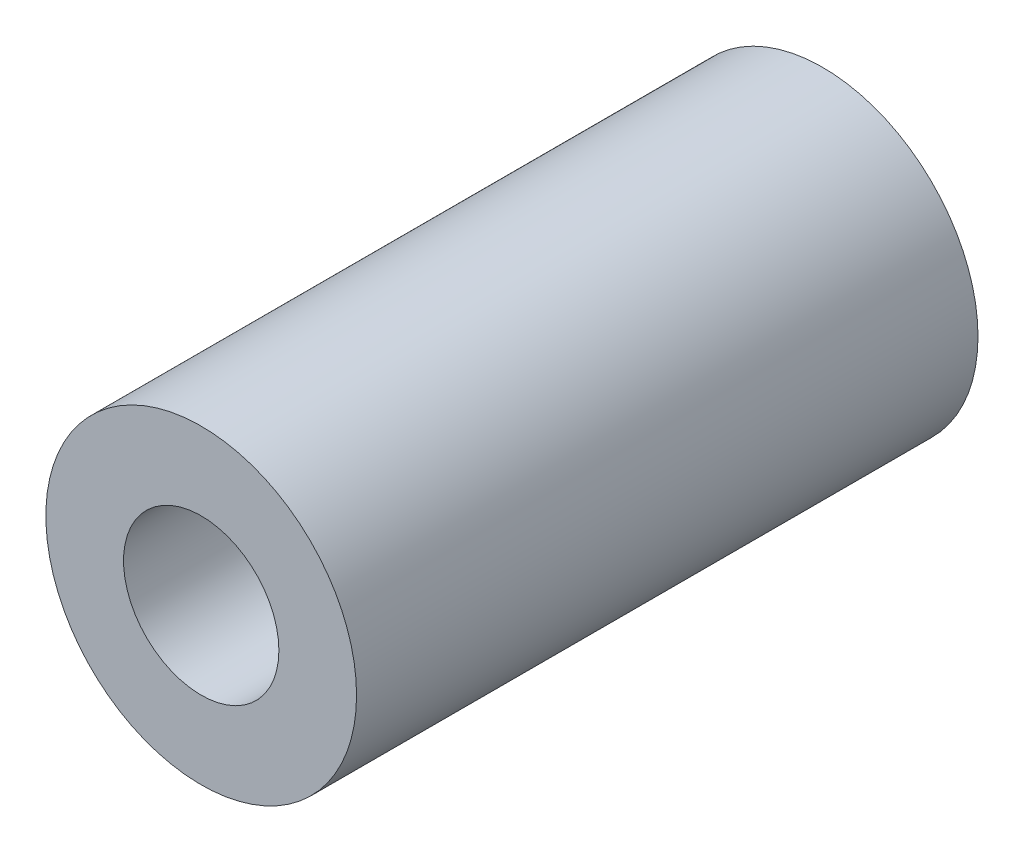
ISO-10303-21;
HEADER;
FILE_DESCRIPTION(('STEP AP214'),'2;1');
FILE_NAME('part.step','',(''),(''),'','','');
FILE_SCHEMA(('AUTOMOTIVE_DESIGN { 1 0 10303 214 1 1 1 1 }'));
ENDSEC;
DATA;
#1=APPLICATION_CONTEXT('core data for automotive mechanical design processes');
#2=APPLICATION_PROTOCOL_DEFINITION('international standard','automotive_design',2000,#1);
#3=PRODUCT_CONTEXT('',#1,'mechanical');
#4=PRODUCT('Part','Part','',(#3));
#5=PRODUCT_RELATED_PRODUCT_CATEGORY('part','',(#4));
#6=PRODUCT_DEFINITION_FORMATION('','',#4);
#7=PRODUCT_DEFINITION_CONTEXT('part definition',#1,'design');
#8=PRODUCT_DEFINITION('design','',#6,#7);
#9=PRODUCT_DEFINITION_SHAPE('','',#8);
#10=(LENGTH_UNIT() NAMED_UNIT(*) SI_UNIT(.MILLI.,.METRE.));
#11=(NAMED_UNIT(*) PLANE_ANGLE_UNIT() SI_UNIT($,.RADIAN.));
#12=(NAMED_UNIT(*) SI_UNIT($,.STERADIAN.) SOLID_ANGLE_UNIT());
#13=UNCERTAINTY_MEASURE_WITH_UNIT(LENGTH_MEASURE(1.E-05),#10,'distance_accuracy_value','');
#14=(GEOMETRIC_REPRESENTATION_CONTEXT(3) GLOBAL_UNCERTAINTY_ASSIGNED_CONTEXT((#13)) GLOBAL_UNIT_ASSIGNED_CONTEXT((#10,
#11,#12)) REPRESENTATION_CONTEXT('',''));
#15=CARTESIAN_POINT('',(0.,0.,0.));
#16=DIRECTION('',(0.,0.,1.));
#17=DIRECTION('',(1.,0.,0.));
#18=AXIS2_PLACEMENT_3D('',#15,#16,#17);
#19=CARTESIAN_POINT('',(0.,0.,20.));
#20=DIRECTION('',(0.,0.,1.));
#21=DIRECTION('',(1.,0.,0.));
#22=AXIS2_PLACEMENT_3D('',#19,#20,#21);
#23=PLANE('',#22);
#24=CARTESIAN_POINT('',(0.,0.,20.));
#25=DIRECTION('',(0.,0.,1.));
#26=DIRECTION('',(1.,0.,0.));
#27=AXIS2_PLACEMENT_3D('',#24,#25,#26);
#28=CIRCLE('',#27,5.);
#29=CARTESIAN_POINT('',(5.,0.,20.));
#30=VERTEX_POINT('',#29);
#31=EDGE_CURVE('E10',#30,#30,#28,.T.);
#32=ORIENTED_EDGE('',*,*,#31,.T.);
#33=EDGE_LOOP('',(#32));
#34=FACE_BOUND('',#33,.T.);
#35=CARTESIAN_POINT('',(0.,0.,20.));
#36=DIRECTION('',(0.,0.,1.));
#37=DIRECTION('',(1.,0.,0.));
#38=AXIS2_PLACEMENT_3D('',#35,#36,#37);
#39=CIRCLE('',#38,2.5);
#40=CARTESIAN_POINT('',(2.5,0.,20.));
#41=VERTEX_POINT('',#40);
#42=EDGE_CURVE('E48',#41,#41,#39,.T.);
#43=ORIENTED_EDGE('',*,*,#42,.F.);
#44=EDGE_LOOP('',(#43));
#45=FACE_BOUND('',#44,.T.);
#46=ADVANCED_FACE('F30',(#34,#45),#23,.T.);
#47=CARTESIAN_POINT('',(0.,0.,0.));
#48=DIRECTION('',(0.,0.,1.));
#49=DIRECTION('',(1.,0.,0.));
#50=AXIS2_PLACEMENT_3D('',#47,#48,#49);
#51=PLANE('',#50);
#52=CARTESIAN_POINT('',(0.,0.,0.));
#53=DIRECTION('',(0.,0.,1.));
#54=DIRECTION('',(1.,0.,0.));
#55=AXIS2_PLACEMENT_3D('',#52,#53,#54);
#56=CIRCLE('',#55,5.);
#57=CARTESIAN_POINT('',(5.,0.,0.));
#58=VERTEX_POINT('',#57);
#59=EDGE_CURVE('E43',#58,#58,#56,.T.);
#60=ORIENTED_EDGE('',*,*,#59,.F.);
#61=EDGE_LOOP('',(#60));
#62=FACE_BOUND('',#61,.T.);
#63=CARTESIAN_POINT('',(0.,0.,0.));
#64=DIRECTION('',(0.,0.,1.));
#65=DIRECTION('',(1.,0.,0.));
#66=AXIS2_PLACEMENT_3D('',#63,#64,#65);
#67=CIRCLE('',#66,2.5);
#68=CARTESIAN_POINT('',(2.5,0.,0.));
#69=VERTEX_POINT('',#68);
#70=EDGE_CURVE('E51',#69,#69,#67,.T.);
#71=ORIENTED_EDGE('',*,*,#70,.T.);
#72=EDGE_LOOP('',(#71));
#73=FACE_BOUND('',#72,.T.);
#74=ADVANCED_FACE('F83',(#62,#73),#51,.F.);
#75=CARTESIAN_POINT('',(0.,0.,20.));
#76=DIRECTION('',(0.,0.,-1.));
#77=DIRECTION('',(-1.,0.,0.));
#78=AXIS2_PLACEMENT_3D('',#75,#76,#77);
#79=CYLINDRICAL_SURFACE('',#78,5.);
#80=CARTESIAN_POINT('',(0.0985903955593224,-4.99902789889229,16.5));
#81=CARTESIAN_POINT('',(0.181173988985378,-4.9973983172279,16.4999987992113));
#82=CARTESIAN_POINT('',(0.263728738356211,-4.99370407236498,16.4931570552624));
#83=CARTESIAN_POINT('',(0.426350404439952,-4.98245705223203,16.4660744697368));
#84=CARTESIAN_POINT('',(0.506416420914054,-4.9749028975741,16.4458288373446));
#85=CARTESIAN_POINT('',(0.661696215089522,-4.95663841633571,16.3927079981128));
#86=CARTESIAN_POINT('',(0.736917699734912,-4.94593326167626,16.3598534603673));
#87=CARTESIAN_POINT('',(0.880754690080715,-4.92235615652566,16.2825325104784));
#88=CARTESIAN_POINT('',(0.949369336947769,-4.90948392492886,16.2380645914747));
#89=CARTESIAN_POINT('',(1.080194492723,-4.88239405460184,16.1373043630164));
#90=CARTESIAN_POINT('',(1.142169426443,-4.86814868700865,16.080713593736));
#91=CARTESIAN_POINT('',(1.25589049671119,-4.84005962388498,15.95794553586));
#92=CARTESIAN_POINT('',(1.30763485996599,-4.82621599834375,15.8917665887575));
#93=CARTESIAN_POINT('',(1.40045695660295,-4.80011455823837,15.7499790457013));
#94=CARTESIAN_POINT('',(1.44129145890563,-4.78789554562473,15.6742034773311));
#95=CARTESIAN_POINT('',(1.50952100476533,-4.76682610450009,15.5163899104987));
#96=CARTESIAN_POINT('',(1.536920009479,-4.7579746833026,15.4343537660806));
#97=CARTESIAN_POINT('',(1.57657092487179,-4.7449814058997,15.2693108155071));
#98=CARTESIAN_POINT('',(1.58930768207363,-4.74068918715845,15.1864325955547));
#99=CARTESIAN_POINT('',(1.60078894500709,-4.73682543999125,15.0196130329558));
#100=CARTESIAN_POINT('',(1.59953721305366,-4.73725264223929,14.9356719822327));
#101=CARTESIAN_POINT('',(1.58343703019074,-4.74265640987733,14.77269731186));
#102=CARTESIAN_POINT('',(1.56913870400632,-4.74744889392073,14.693602270107));
#103=CARTESIAN_POINT('',(1.52823146264147,-4.76077376148698,14.5389984944901));
#104=CARTESIAN_POINT('',(1.50162123089739,-4.76930654497059,14.4634901451187));
#105=CARTESIAN_POINT('',(1.43642853190503,-4.78934731805012,14.3168218167906));
#106=CARTESIAN_POINT('',(1.39766389555963,-4.8009001008894,14.2457491807883));
#107=CARTESIAN_POINT('',(1.3094039846586,-4.82571838590428,14.1109411095385));
#108=CARTESIAN_POINT('',(1.25990587573618,-4.83898434009868,14.0472076191437));
#109=CARTESIAN_POINT('',(1.14881136010374,-4.86658559202589,13.9256956759889));
#110=CARTESIAN_POINT('',(1.08675108631114,-4.88094172939616,13.8683453140252));
#111=CARTESIAN_POINT('',(0.953748889253743,-4.90866295357523,13.7647633947733));
#112=CARTESIAN_POINT('',(0.882806089834772,-4.9220279424118,13.7185329356455));
#113=CARTESIAN_POINT('',(0.732992428130799,-4.94656849697763,13.6380744382917));
#114=CARTESIAN_POINT('',(0.654041653887453,-4.95771785809937,13.6039866607176));
#115=CARTESIAN_POINT('',(0.491102156661873,-4.97649804758986,13.5497234530094));
#116=CARTESIAN_POINT('',(0.407114865575967,-4.98412987069555,13.5295440888655));
#117=CARTESIAN_POINT('',(0.239764307308273,-4.99492604403972,13.5043505200061));
#118=CARTESIAN_POINT('',(0.15649013962331,-4.99824327839354,13.4988097099639));
#119=CARTESIAN_POINT('',(-0.00987844125090942,-5.000681914396,13.5016165257023));
#120=CARTESIAN_POINT('',(-0.0929728814923826,-4.99980399890829,13.5099618910229));
#121=CARTESIAN_POINT('',(-0.25425942316383,-4.99416589488461,13.539848400854));
#122=CARTESIAN_POINT('',(-0.332523384867446,-4.98951188449976,13.561024686254));
#123=CARTESIAN_POINT('',(-0.484406420466471,-4.97706354014433,13.6155767059439));
#124=CARTESIAN_POINT('',(-0.558025034986488,-4.96926889615966,13.6489536445385));
#125=CARTESIAN_POINT('',(-0.700068339682323,-4.95127559566397,13.7276555344731));
#126=CARTESIAN_POINT('',(-0.768370202798684,-4.94103472126363,13.7731921841474));
#127=CARTESIAN_POINT('',(-0.896552493949022,-4.91939287686458,13.8746661105315));
#128=CARTESIAN_POINT('',(-0.956430950569154,-4.9079916363663,13.9306058148823));
#129=CARTESIAN_POINT('',(-1.06825148717409,-4.88489687066707,14.0536233781555));
#130=CARTESIAN_POINT('',(-1.11983984327532,-4.87320719084736,14.1210240902566));
#131=CARTESIAN_POINT('',(-1.21102100551567,-4.85135386379471,14.263734297198));
#132=CARTESIAN_POINT('',(-1.25061386645485,-4.8411902095904,14.3390437559059));
#133=CARTESIAN_POINT('',(-1.3165619986761,-4.82367440731655,14.4954811093413));
#134=CARTESIAN_POINT('',(-1.34293097892513,-4.81631934951951,14.576602878391));
#135=CARTESIAN_POINT('',(-1.38156760545744,-4.80538047414142,14.7423761017078));
#136=CARTESIAN_POINT('',(-1.39383941193629,-4.80179554399013,14.8270265069987));
#137=CARTESIAN_POINT('',(-1.4036482667934,-4.79893686789022,14.9941716717836));
#138=CARTESIAN_POINT('',(-1.40170139292323,-4.7995121174673,15.0766338911978));
#139=CARTESIAN_POINT('',(-1.38436096481662,-4.80454205624111,15.2400052012012));
#140=CARTESIAN_POINT('',(-1.36896788464283,-4.80899660866819,15.3209143464433));
#141=CARTESIAN_POINT('',(-1.3255136732467,-4.82115236973497,15.4780159469491));
#142=CARTESIAN_POINT('',(-1.29759396113538,-4.82881727267182,15.5542505427344));
#143=CARTESIAN_POINT('',(-1.22998372298,-4.84647864290636,15.7010148685009));
#144=CARTESIAN_POINT('',(-1.19029109212225,-4.85647552705751,15.7715435754863));
#145=CARTESIAN_POINT('',(-1.09875064120333,-4.87801417569673,15.9073561586161));
#146=CARTESIAN_POINT('',(-1.04655174787859,-4.8895953981307,15.9723971760437));
#147=CARTESIAN_POINT('',(-0.932101719939085,-4.91269670380159,16.0929708972985));
#148=CARTESIAN_POINT('',(-0.869848289034929,-4.92421677244975,16.1485014231039));
#149=CARTESIAN_POINT('',(-0.735274414661024,-4.94612178801429,16.2497700112115));
#150=CARTESIAN_POINT('',(-0.662751601481626,-4.95647365665806,16.2952469809488));
#151=CARTESIAN_POINT('',(-0.510775238424414,-4.97442936251991,16.3733032991901));
#152=CARTESIAN_POINT('',(-0.431325238834449,-4.98203459727096,16.4058892076878));
#153=CARTESIAN_POINT('',(-0.277287227964994,-4.99283166841481,16.4541171128241));
#154=CARTESIAN_POINT('',(-0.203202565546461,-4.99643278300545,16.4712849228124));
#155=CARTESIAN_POINT('',(-0.0532068532679359,-5.00027938704365,16.4942261498202));
#156=CARTESIAN_POINT('',(0.0227039488999433,-5.00052532903455,16.5000011034103));
#157=CARTESIAN_POINT('',(0.0985903955593224,-4.99902789889229,16.5));
#158=B_SPLINE_CURVE_WITH_KNOTS('',3,(#80,#81,#82,#83,#84,#85,#86,#87,#88,#89,#90,#91,#92,#93,
#94,#95,#96,#97,#98,#99,#100,#101,#102,#103,#104,#105,#106,#107,#108,#109,#110,#111,#112,#113,
#114,#115,#116,#117,#118,#119,#120,#121,#122,#123,#124,#125,#126,#127,#128,#129,#130,#131,#132,
#133,#134,#135,#136,#137,#138,#139,#140,#141,#142,#143,#144,#145,#146,#147,#148,#149,#150,#151,
#152,#153,#154,#155,#156,#157),.UNSPECIFIED.,.T.,.F.,(4,2,2,2,2,2,2,2,2,2,2,2,2,2,2,2,2,2,2,2,2,
2,2,2,2,2,2,2,2,2,2,2,2,2,2,2,2,2,4),(0.,0.247518225957796,0.49512496763348,0.742327542829275,
0.989562209021944,1.24377883789113,1.4980394922835,1.75756850089457,2.01702094709477,
2.26762234345193,2.51815634020152,2.75859118260316,2.99905174165435,3.24330403366689,
3.48762090361346,3.74357185311516,3.99954806901418,4.25839189369009,4.51716247403042,
4.76648866591083,5.01577427521348,5.25828370492414,5.5008170787736,5.74788451379765,
5.99500967661836,6.25083713513628,6.50666342491748,6.76222395294259,7.01770904349717,
7.26396843388298,7.51021914243955,7.75375715554467,7.99733873570878,8.24878473956704,
8.50028825093171,8.75770823733976,9.01499705903001,9.24247338591796,9.46991903065354),.UNSPECIFIED.);
#159=CARTESIAN_POINT('',(0.0985903955593224,-4.99902789889229,16.5));
#160=VERTEX_POINT('',#159);
#161=EDGE_CURVE('E59',#160,#160,#158,.T.);
#162=ORIENTED_EDGE('',*,*,#161,.T.);
#163=EDGE_LOOP('',(#162));
#164=FACE_BOUND('',#163,.T.);
#165=CARTESIAN_POINT('',(0.0328634651864408,-4.99989199809915,6.5));
#166=CARTESIAN_POINT('',(0.115248001643515,-4.99934973441225,6.49999893406111));
#167=CARTESIAN_POINT('',(0.197629720343009,-4.99675318781283,6.49319018861387));
#168=CARTESIAN_POINT('',(0.359966304170237,-4.9876890439514,6.46621258847347));
#169=CARTESIAN_POINT('',(0.439920389174807,-4.98122021587519,6.4460394856688));
#170=CARTESIAN_POINT('',(0.595038267886345,-4.96507862223594,6.39307831244412));
#171=CARTESIAN_POINT('',(0.670209184352877,-4.95541076020943,6.36030953654759));
#172=CARTESIAN_POINT('',(0.813979634353618,-4.9338350933806,6.28316655984981));
#173=CARTESIAN_POINT('',(0.88257829916274,-4.92192699307674,6.23879082771617));
#174=CARTESIAN_POINT('',(1.01328682786246,-4.89671337761127,6.1383080074087));
#175=CARTESIAN_POINT('',(1.07517497570127,-4.88337907354336,6.08191973136557));
#176=CARTESIAN_POINT('',(1.18876810013055,-4.85697829937537,5.95961052272823));
#177=CARTESIAN_POINT('',(1.2404713456072,-4.84391187514402,5.8936879729031));
#178=CARTESIAN_POINT('',(1.33332641756892,-4.8191914809674,5.75239341807298));
#179=CARTESIAN_POINT('',(1.37422192717641,-4.80757477923355,5.67684586019084));
#180=CARTESIAN_POINT('',(1.44263071450651,-4.78749380844821,5.51952670847073));
#181=CARTESIAN_POINT('',(1.47014743889427,-4.77902872760263,5.43775672394944));
#182=CARTESIAN_POINT('',(1.51019242824283,-4.76652387133911,5.27290361876238));
#183=CARTESIAN_POINT('',(1.5231453663051,-4.76235901866462,5.18993338464248));
#184=CARTESIAN_POINT('',(1.53502229771446,-4.75854485317958,5.02290095818472));
#185=CARTESIAN_POINT('',(1.53394981382914,-4.75889440648465,4.93883904534301));
#186=CARTESIAN_POINT('',(1.51813307764928,-4.76396181434415,4.77535048562231));
#187=CARTESIAN_POINT('',(1.50390275886481,-4.76851545103815,4.69586819607809));
#188=CARTESIAN_POINT('',(1.46300210571095,-4.78122148454177,4.54047835209565));
#189=CARTESIAN_POINT('',(1.43633051055633,-4.78937424607825,4.46457116081247));
#190=CARTESIAN_POINT('',(1.37092256084189,-4.80850730374437,4.31721876462094));
#191=CARTESIAN_POINT('',(1.33201844021736,-4.81952652577899,4.24585329606884));
#192=CARTESIAN_POINT('',(1.24337095727181,-4.84315268083182,4.11049397209804));
#193=CARTESIAN_POINT('',(1.19362488928045,-4.85576000983924,4.04650196287327));
#194=CARTESIAN_POINT('',(1.08214051167373,-4.88184222163665,3.92476881558514));
#195=CARTESIAN_POINT('',(1.01997336631808,-4.89533094734143,3.86742269600741));
#196=CARTESIAN_POINT('',(0.88674727286039,-4.92120695579042,3.76387678172719));
#197=CARTESIAN_POINT('',(0.815687661482507,-4.93359415625548,3.71767781922804));
#198=CARTESIAN_POINT('',(0.665884329093425,-4.95604409225237,3.63744350745642));
#199=CARTESIAN_POINT('',(0.587082662254729,-4.9660870450066,3.60351044003789));
#200=CARTESIAN_POINT('',(0.424514906891193,-4.98261489875482,3.54950365597748));
#201=CARTESIAN_POINT('',(0.34075021781116,-4.98910079750593,3.52942605245588));
#202=CARTESIAN_POINT('',(0.173876620590497,-4.99764885120166,3.50434765522393));
#203=CARTESIAN_POINT('',(0.0908532529488043,-4.99986228837017,3.49882862461061));
#204=CARTESIAN_POINT('',(-0.0749635896837471,-5.00012508759384,3.50158536271815));
#205=CARTESIAN_POINT('',(-0.157757095885825,-4.99817504575956,3.50985915659945));
#206=CARTESIAN_POINT('',(-0.318684237489182,-4.99046886420399,3.53953795341165));
#207=CARTESIAN_POINT('',(-0.396882102638044,-4.98480566677105,3.56062140171428));
#208=CARTESIAN_POINT('',(-0.548625458419852,-4.97039475582472,3.61494860201404));
#209=CARTESIAN_POINT('',(-0.622170421798301,-4.96164669347835,3.64819372925576));
#210=CARTESIAN_POINT('',(-0.76429416711462,-4.94177284312931,3.72670763375986));
#211=CARTESIAN_POINT('',(-0.832730859009255,-4.9305996532503,3.77222127018923));
#212=CARTESIAN_POINT('',(-0.961175055982208,-4.90717964760359,3.87368321730435));
#213=CARTESIAN_POINT('',(-1.02118049092883,-4.89493256935803,3.92963408282749));
#214=CARTESIAN_POINT('',(-1.13329553431253,-4.87022168175905,4.0527665117073));
#215=CARTESIAN_POINT('',(-1.18504352766203,-4.8577659204395,4.12027963093167));
#216=CARTESIAN_POINT('',(-1.27650864911004,-4.83453828869739,4.26328592417487));
#217=CARTESIAN_POINT('',(-1.3162260016315,-4.82376638686545,4.33877894929886));
#218=CARTESIAN_POINT('',(-1.38228368878957,-4.80525461281297,4.49546120949806));
#219=CARTESIAN_POINT('',(-1.40866974097057,-4.79750439937115,4.57662987531785));
#220=CARTESIAN_POINT('',(-1.44732412382905,-4.78598656369067,4.74252682525942));
#221=CARTESIAN_POINT('',(-1.45959706079984,-4.78221764205525,4.82725393859761));
#222=CARTESIAN_POINT('',(-1.46936262562512,-4.779225520872,4.99424282699532));
#223=CARTESIAN_POINT('',(-1.46742366245026,-4.77982749674387,5.07646863731956));
#224=CARTESIAN_POINT('',(-1.45017770779809,-4.78508767689333,5.23936715984536));
#225=CARTESIAN_POINT('',(-1.43487123136292,-4.78974572489289,5.32003993176215));
#226=CARTESIAN_POINT('',(-1.39169475726756,-4.80246595704655,5.47660462649708));
#227=CARTESIAN_POINT('',(-1.36397701296561,-4.8104868146803,5.55254214550827));
#228=CARTESIAN_POINT('',(-1.29688152317273,-4.82900652540907,5.6987498647429));
#229=CARTESIAN_POINT('',(-1.25750159457359,-4.83950584238575,5.76901900073417));
#230=CARTESIAN_POINT('',(-1.16658114965369,-4.86223755858168,5.90455671003712));
#231=CARTESIAN_POINT('',(-1.11466308878945,-4.87451777146192,5.96956401053393));
#232=CARTESIAN_POINT('',(-1.00081573191761,-4.89915857658413,6.09013049895808));
#233=CARTESIAN_POINT('',(-0.938883942266751,-4.91151918810941,6.14568732641572));
#234=CARTESIAN_POINT('',(-0.804725444764941,-4.93529904382095,6.24728302995267));
#235=CARTESIAN_POINT('',(-0.732263945059676,-4.94668340034175,6.29302084564412));
#236=CARTESIAN_POINT('',(-0.580336231050097,-4.966796351802,6.37160190331808));
#237=CARTESIAN_POINT('',(-0.500873415276501,-4.97552622620128,6.4044513597109));
#238=CARTESIAN_POINT('',(-0.346248637105305,-4.9885324173585,6.45330916101533));
#239=CARTESIAN_POINT('',(-0.271576554835411,-4.99319327692172,6.47077362372063));
#240=CARTESIAN_POINT('',(-0.120314147365359,-4.99912485645963,6.4941186345218));
#241=CARTESIAN_POINT('',(-0.0437241235052176,-5.00039610566595,6.50000099093463));
#242=CARTESIAN_POINT('',(0.0328634651864408,-4.99989199809915,6.5));
#243=B_SPLINE_CURVE_WITH_KNOTS('',3,(#165,#166,#167,#168,#169,#170,#171,#172,#173,#174,#175,
#176,#177,#178,#179,#180,#181,#182,#183,#184,#185,#186,#187,#188,#189,#190,#191,#192,#193,#194,
#195,#196,#197,#198,#199,#200,#201,#202,#203,#204,#205,#206,#207,#208,#209,#210,#211,#212,#213,
#214,#215,#216,#217,#218,#219,#220,#221,#222,#223,#224,#225,#226,#227,#228,#229,#230,#231,#232,
#233,#234,#235,#236,#237,#238,#239,#240,#241,#242),.UNSPECIFIED.,.T.,.F.,(4,2,2,2,2,2,2,2,2,2,2,
2,2,2,2,2,2,2,2,2,2,2,2,2,2,2,2,2,2,2,2,2,2,2,2,2,2,2,4),(0.,0.246876957609637,
0.493832427365347,0.740411099447683,0.987022319643986,1.24020741072899,1.49343549827461,
1.75221804088872,2.0109338801378,2.26189242678193,2.51278794133646,2.75427972675162,
2.99579598999623,3.2407807700433,3.48582675759937,3.74157402287944,3.99734037535087,
4.25519280282207,4.51297286539471,4.76144461982293,5.00988080142792,5.25232440148982,
5.49479542559124,5.74251892296139,5.99030313814364,6.24699943577504,6.50369094462666,
6.75949609260575,7.01521772618999,7.26076916955264,7.50631115238497,7.74892017188195,
7.99157463542964,8.2427262472144,8.49394049798497,8.75200918213639,9.00995327933453,
9.23949470131289,9.46900028209269),.UNSPECIFIED.);
#244=CARTESIAN_POINT('',(0.0328634651864408,-4.99989199809915,6.5));
#245=VERTEX_POINT('',#244);
#246=EDGE_CURVE('E58',#245,#245,#243,.T.);
#247=ORIENTED_EDGE('',*,*,#246,.T.);
#248=EDGE_LOOP('',(#247));
#249=FACE_BOUND('',#248,.T.);
#250=ORIENTED_EDGE('',*,*,#31,.F.);
#251=EDGE_LOOP('',(#250));
#252=FACE_BOUND('',#251,.T.);
#253=ORIENTED_EDGE('',*,*,#59,.T.);
#254=EDGE_LOOP('',(#253));
#255=FACE_BOUND('',#254,.T.);
#256=ADVANCED_FACE('F32',(#164,#249,#252,#255),#79,.T.);
#257=CARTESIAN_POINT('',(0.,0.,20.));
#258=DIRECTION('',(0.,0.,-1.));
#259=DIRECTION('',(-1.,0.,0.));
#260=AXIS2_PLACEMENT_3D('',#257,#258,#259);
#261=CYLINDRICAL_SURFACE('',#260,2.5);
#262=CARTESIAN_POINT('',(0.0985903955593224,-2.4980552303549,16.5));
#263=CARTESIAN_POINT('',(0.176198239864467,-2.49498870029856,16.4999961166681));
#264=CARTESIAN_POINT('',(0.253792089735478,-2.48826737449242,16.4939340214424));
#265=CARTESIAN_POINT('',(0.406349181523985,-2.46796240833583,16.4701286861536));
#266=CARTESIAN_POINT('',(0.481304759295952,-2.45436029803537,16.4523539670636));
#267=CARTESIAN_POINT('',(0.626064367564046,-2.42147130017995,16.4062396327524));
#268=CARTESIAN_POINT('',(0.695894357637827,-2.40221594679761,16.377958397361));
#269=CARTESIAN_POINT('',(0.829457861849081,-2.35943299047257,16.3120157014723));
#270=CARTESIAN_POINT('',(0.893193481653165,-2.33590687132525,16.2743574971388));
#271=CARTESIAN_POINT('',(1.01903559962847,-2.28398620296232,16.1870751732125));
#272=CARTESIAN_POINT('',(1.08051343136435,-2.25534589772632,16.1366931392013));
#273=CARTESIAN_POINT('',(1.19463058818197,-2.19703770290626,16.0271157360719));
#274=CARTESIAN_POINT('',(1.24725583153342,-2.16736826503243,15.9679066027096));
#275=CARTESIAN_POINT('',(1.34894360422737,-2.10578007926849,15.8334297772147));
#276=CARTESIAN_POINT('',(1.39670245792359,-2.07405496285937,15.7570774878731));
#277=CARTESIAN_POINT('',(1.47838224827009,-2.01665254015181,15.5952652177948));
#278=CARTESIAN_POINT('',(1.51233398565049,-1.99096182711651,15.5098260515174));
#279=CARTESIAN_POINT('',(1.55687170492393,-1.95619706003143,15.3574592127223));
#280=CARTESIAN_POINT('',(1.5713703350311,-1.94446858369791,15.2922820980668));
#281=CARTESIAN_POINT('',(1.59155987621029,-1.92798186262728,15.1597471190554));
#282=CARTESIAN_POINT('',(1.5972627808152,-1.92321412695103,15.0923923523274));
#283=CARTESIAN_POINT('',(1.59950676218242,-1.92134885130855,14.957279981819));
#284=CARTESIAN_POINT('',(1.59602865132772,-1.92426737500477,14.8895218301305));
#285=CARTESIAN_POINT('',(1.58010816532375,-1.93735856637936,14.7557655952343));
#286=CARTESIAN_POINT('',(1.56765805568563,-1.94753749295414,14.6897690816225));
#287=CARTESIAN_POINT('',(1.53469485871701,-1.97361114293813,14.5619158898616));
#288=CARTESIAN_POINT('',(1.51427747222371,-1.98943784065341,14.5000199157398));
#289=CARTESIAN_POINT('',(1.46616540575322,-2.02515557075738,14.3804033071101));
#290=CARTESIAN_POINT('',(1.43846819577779,-2.04504801560263,14.3226841331004));
#291=CARTESIAN_POINT('',(1.37027131893975,-2.09150084336514,14.2008602115706));
#292=CARTESIAN_POINT('',(1.32832046246647,-2.11860014653532,14.1377736339184));
#293=CARTESIAN_POINT('',(1.23570851949115,-2.17392305088583,14.0188518365961));
#294=CARTESIAN_POINT('',(1.18503833037618,-2.20214780308859,13.9630243030786));
#295=CARTESIAN_POINT('',(1.06595512117718,-2.26250703397485,13.8501907955472));
#296=CARTESIAN_POINT('',(0.995988918194025,-2.29445562892041,13.7947058272563));
#297=CARTESIAN_POINT('',(0.845956439298647,-2.35390293216934,13.6963602302734));
#298=CARTESIAN_POINT('',(0.765892903451274,-2.38140284308669,13.653496187185));
#299=CARTESIAN_POINT('',(0.601232991109285,-2.42806521686994,13.5840327859447));
#300=CARTESIAN_POINT('',(0.517004414058291,-2.44754802167074,13.5567865299578));
#301=CARTESIAN_POINT('',(0.343612047062342,-2.47782906174299,13.5174907907569));
#302=CARTESIAN_POINT('',(0.254455631569455,-2.48863991747047,13.5054192089712));
#303=CARTESIAN_POINT('',(0.088221542080367,-2.49962079654471,13.4980818982193));
#304=CARTESIAN_POINT('',(0.0113236020208352,-2.50113634578574,13.5005800028067));
#305=CARTESIAN_POINT('',(-0.140999632909966,-2.49718178425371,13.5172790516236));
#306=CARTESIAN_POINT('',(-0.21642511442819,-2.49171256477553,13.5314785026149));
#307=CARTESIAN_POINT('',(-0.359947427082042,-2.47495699332994,13.5699652809755));
#308=CARTESIAN_POINT('',(-0.428222277800117,-2.46396684401527,13.5937277658644));
#309=CARTESIAN_POINT('',(-0.559906055027132,-2.43742095941598,13.6503618070882));
#310=CARTESIAN_POINT('',(-0.62331418221416,-2.42186447616172,13.6832348556924));
#311=CARTESIAN_POINT('',(-0.749474277955611,-2.38599180466767,13.7603545590521));
#312=CARTESIAN_POINT('',(-0.81168668139496,-2.36537882373446,13.8053431285049));
#313=CARTESIAN_POINT('',(-0.928198714490465,-2.32213638421217,13.9038546970935));
#314=CARTESIAN_POINT('',(-0.982490515028266,-2.29950496561927,13.9573860323749));
#315=CARTESIAN_POINT('',(-1.08864300771863,-2.25136884029573,14.0792389437808));
#316=CARTESIAN_POINT('',(-1.13934489553054,-2.2258597401614,14.1485734439612));
#317=CARTESIAN_POINT('',(-1.22854287031649,-2.17790087219901,14.2956555851952));
#318=CARTESIAN_POINT('',(-1.26704691399509,-2.15544911552599,14.3733976973436));
#319=CARTESIAN_POINT('',(-1.32506081750332,-2.12018121291584,14.5220266835367));
#320=CARTESIAN_POINT('',(-1.34668091276272,-2.10637791654448,14.5918519200449));
#321=CARTESIAN_POINT('',(-1.37959177838366,-2.0849747521574,14.7347835664932));
#322=CARTESIAN_POINT('',(-1.39089526106926,-2.077367250815,14.8078858215219));
#323=CARTESIAN_POINT('',(-1.4025889881778,-2.06949249924519,14.9556344490495));
#324=CARTESIAN_POINT('',(-1.40294036719684,-2.06925138997365,15.0302853801183));
#325=CARTESIAN_POINT('',(-1.39260634046653,-2.0762182579342,15.1784779341755));
#326=CARTESIAN_POINT('',(-1.3819162344398,-2.08342940753773,15.2520190712061));
#327=CARTESIAN_POINT('',(-1.3508998271028,-2.10366006506185,15.3922872647591));
#328=CARTESIAN_POINT('',(-1.33107239403086,-2.11637702273648,15.4591716004799));
#329=CARTESIAN_POINT('',(-1.28277505821681,-2.14599338564403,15.5887407140439));
#330=CARTESIAN_POINT('',(-1.25430187439917,-2.16289437827402,15.6514238864954));
#331=CARTESIAN_POINT('',(-1.18516011447956,-2.20162717113169,15.7797284573998));
#332=CARTESIAN_POINT('',(-1.14337600297589,-2.22381553930898,15.8446400749542));
#333=CARTESIAN_POINT('',(-1.05056095026631,-2.269139017584,15.9671424565484));
#334=CARTESIAN_POINT('',(-0.99952312324386,-2.29227482269076,16.0247277142754));
#335=CARTESIAN_POINT('',(-0.881568262058223,-2.34038719492943,16.1388085183277));
#336=CARTESIAN_POINT('',(-0.81344128470559,-2.36519778934128,16.1941346350605));
#337=CARTESIAN_POINT('',(-0.667505920118126,-2.41044828037908,16.2926074958303));
#338=CARTESIAN_POINT('',(-0.5896959595906,-2.43088746526714,16.3357522569064));
#339=CARTESIAN_POINT('',(-0.430079983310841,-2.46401511804395,16.4063332095696));
#340=CARTESIAN_POINT('',(-0.348617152049226,-2.477014077089,16.4343951161586));
#341=CARTESIAN_POINT('',(-0.181383943368378,-2.49481649030034,16.4761386518072));
#342=CARTESIAN_POINT('',(-0.0956301029342801,-2.49964923687222,16.4898716110295));
#343=CARTESIAN_POINT('',(0.00849211159670258,-2.50005145199479,16.4974015844093));
#344=CARTESIAN_POINT('',(0.0265019692489444,-2.49992455483515,16.4983753254676));
#345=CARTESIAN_POINT('',(0.0625382683355768,-2.49928256590997,16.4996749777616));
#346=CARTESIAN_POINT('',(0.0805647094307257,-2.49876748191651,16.5000009019671));
#347=CARTESIAN_POINT('',(0.0985903955593224,-2.4980552303549,16.5));
#348=B_SPLINE_CURVE_WITH_KNOTS('',3,(#262,#263,#264,#265,#266,#267,#268,#269,#270,#271,#272,
#273,#274,#275,#276,#277,#278,#279,#280,#281,#282,#283,#284,#285,#286,#287,#288,#289,#290,#291,
#292,#293,#294,#295,#296,#297,#298,#299,#300,#301,#302,#303,#304,#305,#306,#307,#308,#309,#310,
#311,#312,#313,#314,#315,#316,#317,#318,#319,#320,#321,#322,#323,#324,#325,#326,#327,#328,#329,
#330,#331,#332,#333,#334,#335,#336,#337,#338,#339,#340,#341,#342,#343,#344,#345,#346,#347),
.UNSPECIFIED.,.T.,.F.,(4,2,2,2,2,2,2,2,2,2,2,2,2,2,2,2,2,2,2,2,2,2,2,2,2,2,2,2,2,2,2,2,2,2,2,2,
2,2,2,2,2,2,4),(0.,0.232926800448686,0.466482185884106,0.698758764087016,0.930954796176111,
1.18343421491337,1.43631152854202,1.72134036901237,2.00572983624867,2.20825960174384,
2.41051296006064,2.6131893468534,2.81604066416362,3.01652688433436,3.21708287295653,
3.45758771084295,3.69834516590023,3.98146416993053,4.26450650996227,4.53477116393295,
4.8046417792584,5.03429972037827,5.26392835881026,5.48237636056848,5.70086016429414,
5.93839953823479,6.17617213982034,6.44376433108572,6.71118160970938,6.93340839329606,
7.1553609737009,7.37810110127577,7.60093608674741,7.81283072450219,8.02480587731057,
8.26484624631975,8.50506597123906,8.77732078863746,9.04961989994186,9.30952257111813,
9.56849097032154,9.62259309744911,9.67669414140181),.UNSPECIFIED.);
#349=CARTESIAN_POINT('',(0.0985903955593224,-2.4980552303549,16.5));
#350=VERTEX_POINT('',#349);
#351=EDGE_CURVE('E35',#350,#350,#348,.T.);
#352=ORIENTED_EDGE('',*,*,#351,.F.);
#353=EDGE_LOOP('',(#352));
#354=FACE_BOUND('',#353,.T.);
#355=CARTESIAN_POINT('',(0.0328634651864408,-2.49978398919906,6.5));
#356=CARTESIAN_POINT('',(0.109880227126964,-2.49876780859674,6.49999599137514));
#357=CARTESIAN_POINT('',(0.186975237240588,-2.49415901279572,6.49402658504951));
#358=CARTESIAN_POINT('',(0.338749030654369,-2.47812558633037,6.47049741934402));
#359=CARTESIAN_POINT('',(0.413421146782335,-2.46668359441652,6.45290812493242));
#360=CARTESIAN_POINT('',(0.557831045603462,-2.43807626834533,6.40716602645972));
#361=CARTESIAN_POINT('',(0.627592075705413,-2.42094045517569,6.37906761695727));
#362=CARTESIAN_POINT('',(0.761143469991813,-2.38233067815022,6.31344945821627));
#363=CARTESIAN_POINT('',(0.824935503498958,-2.36085793252303,6.27593235393749));
#364=CARTESIAN_POINT('',(0.950508535834087,-2.31330775854198,6.18920499465));
#365=CARTESIAN_POINT('',(1.01172023744724,-2.28699936723097,6.13929932932771));
#366=CARTESIAN_POINT('',(1.1254185672645,-2.23324816562402,6.03078197552005));
#367=CARTESIAN_POINT('',(1.1778930576328,-2.20580384224027,5.97215838639244));
#368=CARTESIAN_POINT('',(1.27922522672927,-2.14880454605526,5.83928957178325));
#369=CARTESIAN_POINT('',(1.32682672186668,-2.11941007700348,5.76400860443315));
#370=CARTESIAN_POINT('',(1.40847809703752,-2.06605375818069,5.60469662731941));
#371=CARTESIAN_POINT('',(1.4425524400766,-2.04208213562924,5.52068176281563));
#372=CARTESIAN_POINT('',(1.48852900463592,-2.00869913032391,5.36830139416075));
#373=CARTESIAN_POINT('',(1.50387661128481,-1.99713016234839,5.30144972851088));
#374=CARTESIAN_POINT('',(1.52528838812293,-1.98082903644669,5.16549228506637));
#375=CARTESIAN_POINT('',(1.5313644766121,-1.97608810169926,5.09638951797909));
#376=CARTESIAN_POINT('',(1.53387370836708,-1.9741416225132,4.95776076948497));
#377=CARTESIAN_POINT('',(1.53028748044615,-1.97695121548035,4.88823421713709));
#378=CARTESIAN_POINT('',(1.51366519204604,-1.98970381336509,4.75097298894502));
#379=CARTESIAN_POINT('',(1.50062168420265,-1.99965244002411,4.68323976890037));
#380=CARTESIAN_POINT('',(1.46601602831263,-2.02515326275515,4.55209219327604));
#381=CARTESIAN_POINT('',(1.44456304827922,-2.04063343165426,4.48863424354009));
#382=CARTESIAN_POINT('',(1.39393858654637,-2.07554300710298,4.36606211001243));
#383=CARTESIAN_POINT('',(1.36476432265765,-2.09497383659731,4.30694950179572));
#384=CARTESIAN_POINT('',(1.29339769321458,-2.13990786234527,4.18327454450704));
#385=CARTESIAN_POINT('',(1.24980069286135,-2.16587187359464,4.11968996504258));
#386=CARTESIAN_POINT('',(1.15359372073182,-2.21861159778329,4.00006782952778));
#387=CARTESIAN_POINT('',(1.10097483230475,-2.24538809197158,3.94403783875828));
#388=CARTESIAN_POINT('',(0.978810806299887,-2.30154262245096,3.83251866069923));
#389=CARTESIAN_POINT('',(0.907909558542293,-2.33070290863522,3.77838884048194));
#390=CARTESIAN_POINT('',(0.756297971116602,-2.38421101553208,3.68293831998798));
#391=CARTESIAN_POINT('',(0.675592113939888,-2.4085610221462,3.64161179672481));
#392=CARTESIAN_POINT('',(0.511217646409227,-2.44854803865831,3.57572730897585));
#393=CARTESIAN_POINT('',(0.427988537434022,-2.46460665161584,3.55033952611194));
#394=CARTESIAN_POINT('',(0.257263381657025,-2.48821374589904,3.51432593567355));
#395=CARTESIAN_POINT('',(0.169772956770136,-2.49577313900543,3.50368119606096));
#396=CARTESIAN_POINT('',(0.00636764532544239,-2.50113793980097,3.49832666803333));
#397=CARTESIAN_POINT('',(-0.0694485680046786,-2.50016335642332,3.50159018741333));
#398=CARTESIAN_POINT('',(-0.219335877546553,-2.491490031467,3.51942983870344));
#399=CARTESIAN_POINT('',(-0.293407065756536,-2.48379164518754,3.53400537285951));
#400=CARTESIAN_POINT('',(-0.435376436839137,-2.46281117585502,3.5731139687305));
#401=CARTESIAN_POINT('',(-0.503396633393319,-2.44971705597427,3.59731095194073));
#402=CARTESIAN_POINT('',(-0.634432817393489,-2.41909636652719,3.65469850240364));
#403=CARTESIAN_POINT('',(-0.697447864127364,-2.40156896630909,3.68789075515905));
#404=CARTESIAN_POINT('',(-0.823399349950572,-2.36152479024523,3.76596880468593));
#405=CARTESIAN_POINT('',(-0.885718004633951,-2.33868678198171,3.81168381985965));
#406=CARTESIAN_POINT('',(-1.0022876615905,-2.29115496733463,3.91171148043512));
#407=CARTESIAN_POINT('',(-1.05652968483678,-2.26645914078097,3.96603355815763));
#408=CARTESIAN_POINT('',(-1.16259531188053,-2.21411383482288,4.08986010300894));
#409=CARTESIAN_POINT('',(-1.21320961200035,-2.18649319226501,4.16041874063313));
#410=CARTESIAN_POINT('',(-1.30194608913547,-2.13484824348705,4.31018763053588));
#411=CARTESIAN_POINT('',(-1.34007961908045,-2.11082067974909,4.38938993228915));
#412=CARTESIAN_POINT('',(-1.39607568438522,-2.07409351470474,4.53833702749242));
#413=CARTESIAN_POINT('',(-1.41646701596682,-2.06008944450664,4.60680550287445));
#414=CARTESIAN_POINT('',(-1.44735972192338,-2.03850743663102,4.74688548442967));
#415=CARTESIAN_POINT('',(-1.45787429782711,-2.03092092243476,4.81849266086959));
#416=CARTESIAN_POINT('',(-1.46844240919573,-2.0232954713773,4.96316146667028));
#417=CARTESIAN_POINT('',(-1.46845732463505,-2.02328439863493,5.03622747701281));
#418=CARTESIAN_POINT('',(-1.45792585605081,-2.03088400872605,5.18120547321773));
#419=CARTESIAN_POINT('',(-1.44737414596092,-2.03849853521314,5.25311685852361));
#420=CARTESIAN_POINT('',(-1.41709663626389,-2.05964847926393,5.39027469046529));
#421=CARTESIAN_POINT('',(-1.39784043155257,-2.07287893251288,5.45567523818715));
#422=CARTESIAN_POINT('',(-1.35111546402061,-2.10363175083191,5.58238092275334));
#423=CARTESIAN_POINT('',(-1.3236435980217,-2.12115573718091,5.64368450138746));
#424=CARTESIAN_POINT('',(-1.25663902812411,-2.16162009958466,5.77007960262304));
#425=CARTESIAN_POINT('',(-1.21592960137734,-2.18497783134607,5.83441239878771));
#426=CARTESIAN_POINT('',(-1.12553245827899,-2.23288991565195,5.95596219227602));
#427=CARTESIAN_POINT('',(-1.07583756624345,-2.25744521302898,6.01317344031301));
#428=CARTESIAN_POINT('',(-0.959928063867371,-2.30936308953824,6.12782209776515));
#429=CARTESIAN_POINT('',(-0.89234957039107,-2.3365815242117,6.18395909945522));
#430=CARTESIAN_POINT('',(-0.747314550572442,-2.38692369776602,6.28416596953603));
#431=CARTESIAN_POINT('',(-0.669855191855892,-2.41004625799691,6.32823236641387));
#432=CARTESIAN_POINT('',(-0.509824536542889,-2.44879772698258,6.40104825318235));
#433=CARTESIAN_POINT('',(-0.427539380917147,-2.46466737870469,6.43029399679987));
#434=CARTESIAN_POINT('',(-0.258174797831115,-2.48808907230244,6.47407109936179));
#435=CARTESIAN_POINT('',(-0.171114408818983,-2.49567193472983,6.48865696552259));
#436=CARTESIAN_POINT('',(-0.064132052213336,-2.49925357528941,6.49698792929678));
#437=CARTESIAN_POINT('',(-0.0447546788484945,-2.49967471727851,6.49811630917579));
#438=CARTESIAN_POINT('',(-0.00596537345244415,-2.50006802373164,6.49962285563092));
#439=CARTESIAN_POINT('',(0.0134465591076455,-2.50004018126449,6.50000101062536));
#440=CARTESIAN_POINT('',(0.0328634651864408,-2.49978398919906,6.5));
#441=B_SPLINE_CURVE_WITH_KNOTS('',3,(#355,#356,#357,#358,#359,#360,#361,#362,#363,#364,#365,
#366,#367,#368,#369,#370,#371,#372,#373,#374,#375,#376,#377,#378,#379,#380,#381,#382,#383,#384,
#385,#386,#387,#388,#389,#390,#391,#392,#393,#394,#395,#396,#397,#398,#399,#400,#401,#402,#403,
#404,#405,#406,#407,#408,#409,#410,#411,#412,#413,#414,#415,#416,#417,#418,#419,#420,#421,#422,
#423,#424,#425,#426,#427,#428,#429,#430,#431,#432,#433,#434,#435,#436,#437,#438,#439,#440),
.UNSPECIFIED.,.T.,.F.,(4,2,2,2,2,2,2,2,2,2,2,2,2,2,2,2,2,2,2,2,2,2,2,2,2,2,2,2,2,2,2,2,2,2,2,2,
2,2,2,2,2,2,4),(0.,0.230986667532739,0.462562719680943,0.692956372448816,0.923285398254298,
1.17204348752362,1.42114432210696,1.7011464076291,1.98063979472679,2.18843933584844,
2.39597153026121,2.6039200984054,2.8120325987856,3.01752847181206,3.22309849165923,
3.46622997721165,3.70960315813844,3.98972800191165,4.26972525621172,4.53356992351443,
4.79707546387344,5.02359997198866,5.25011251081932,5.46932441080493,5.6885774143977,
5.92940319955354,6.17049475023517,6.44260896980732,6.71447497267882,6.93197110676097,
7.14917611444407,7.36718004503631,7.5852939149948,7.79283287072635,8.00045031625076,
8.23845363412257,8.47664786483968,8.75122721495858,9.02588545154046,9.29061174754653,
9.5543500765723,9.6125838568454,9.67081853610134),.UNSPECIFIED.);
#442=CARTESIAN_POINT('',(0.0328634651864408,-2.49978398919906,6.5));
#443=VERTEX_POINT('',#442);
#444=EDGE_CURVE('E53',#443,#443,#441,.T.);
#445=ORIENTED_EDGE('',*,*,#444,.F.);
#446=EDGE_LOOP('',(#445));
#447=FACE_BOUND('',#446,.T.);
#448=ORIENTED_EDGE('',*,*,#42,.T.);
#449=EDGE_LOOP('',(#448));
#450=FACE_BOUND('',#449,.T.);
#451=ORIENTED_EDGE('',*,*,#70,.F.);
#452=EDGE_LOOP('',(#451));
#453=FACE_BOUND('',#452,.T.);
#454=ADVANCED_FACE('F60',(#354,#447,#450,#453),#261,.F.);
#455=CARTESIAN_POINT('',(0.0328634651864408,-10.,5.));
#456=DIRECTION('',(0.,1.,0.));
#457=DIRECTION('',(0.,0.,1.));
#458=AXIS2_PLACEMENT_3D('',#455,#456,#457);
#459=CYLINDRICAL_SURFACE('',#458,1.5);
#460=ORIENTED_EDGE('',*,*,#444,.T.);
#461=EDGE_LOOP('',(#460));
#462=FACE_BOUND('',#461,.T.);
#463=ORIENTED_EDGE('',*,*,#246,.F.);
#464=EDGE_LOOP('',(#463));
#465=FACE_BOUND('',#464,.T.);
#466=ADVANCED_FACE('F63',(#462,#465),#459,.F.);
#467=CARTESIAN_POINT('',(0.0985903955593224,-10.,15.));
#468=DIRECTION('',(0.,1.,0.));
#469=DIRECTION('',(0.,0.,1.));
#470=AXIS2_PLACEMENT_3D('',#467,#468,#469);
#471=CYLINDRICAL_SURFACE('',#470,1.5);
#472=ORIENTED_EDGE('',*,*,#351,.T.);
#473=EDGE_LOOP('',(#472));
#474=FACE_BOUND('',#473,.T.);
#475=ORIENTED_EDGE('',*,*,#161,.F.);
#476=EDGE_LOOP('',(#475));
#477=FACE_BOUND('',#476,.T.);
#478=ADVANCED_FACE('F66',(#474,#477),#471,.F.);
#479=CLOSED_SHELL('',(#46,#74,#256,#454,#466,#478));
#480=MANIFOLD_SOLID_BREP('B2',#479);
#481=ADVANCED_BREP_SHAPE_REPRESENTATION('',(#18,#480),#14);
#482=SHAPE_DEFINITION_REPRESENTATION(#9,#481);
ENDSEC;
END-ISO-10303-21;
